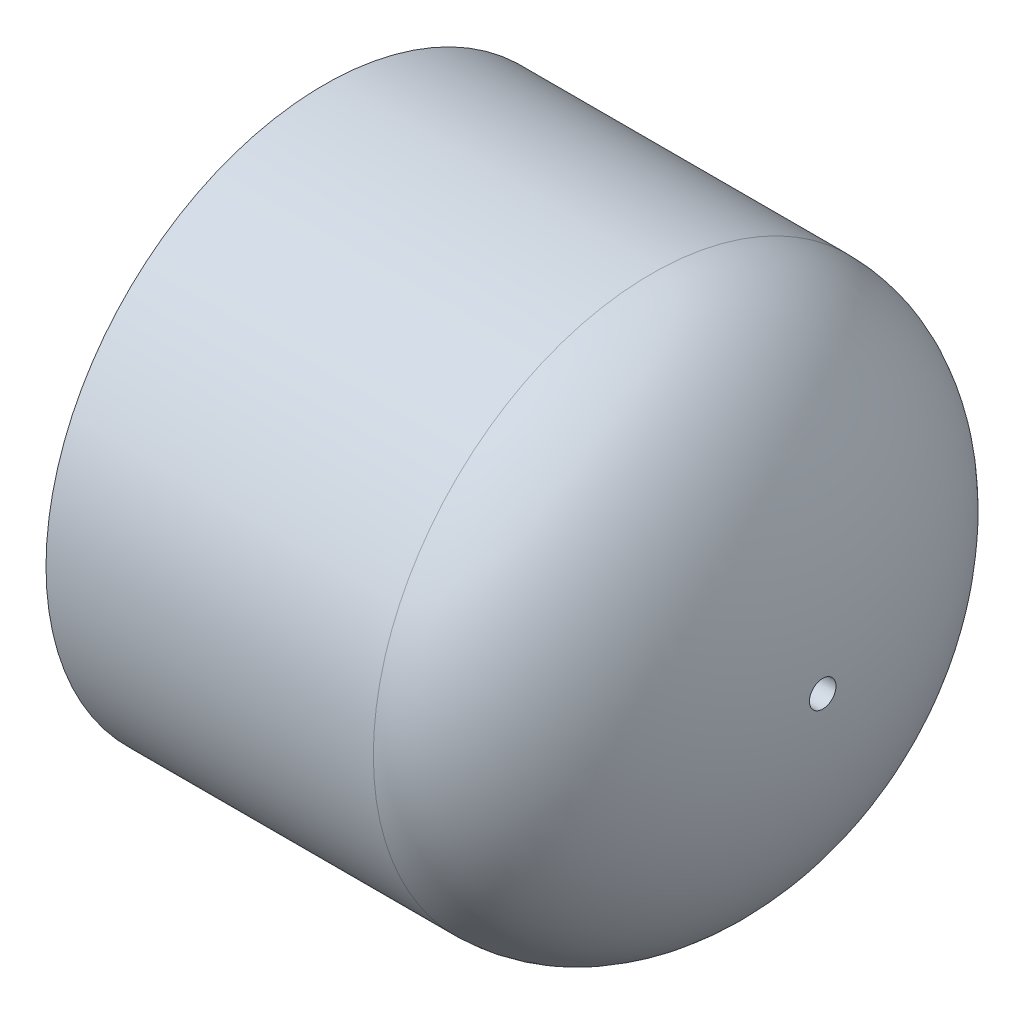
ISO-10303-21;
HEADER;
FILE_DESCRIPTION(('STEP AP214'),'2;1');
FILE_NAME('part.step','',(''),(''),'','','');
FILE_SCHEMA(('AUTOMOTIVE_DESIGN { 1 0 10303 214 1 1 1 1 }'));
ENDSEC;
DATA;
#1=APPLICATION_CONTEXT('core data for automotive mechanical design processes');
#2=APPLICATION_PROTOCOL_DEFINITION('international standard','automotive_design',2000,#1);
#3=PRODUCT_CONTEXT('',#1,'mechanical');
#4=PRODUCT('Part','Part','',(#3));
#5=PRODUCT_RELATED_PRODUCT_CATEGORY('part','',(#4));
#6=PRODUCT_DEFINITION_FORMATION('','',#4);
#7=PRODUCT_DEFINITION_CONTEXT('part definition',#1,'design');
#8=PRODUCT_DEFINITION('design','',#6,#7);
#9=PRODUCT_DEFINITION_SHAPE('','',#8);
#10=(LENGTH_UNIT() NAMED_UNIT(*) SI_UNIT(.MILLI.,.METRE.));
#11=(NAMED_UNIT(*) PLANE_ANGLE_UNIT() SI_UNIT($,.RADIAN.));
#12=(NAMED_UNIT(*) SI_UNIT($,.STERADIAN.) SOLID_ANGLE_UNIT());
#13=UNCERTAINTY_MEASURE_WITH_UNIT(LENGTH_MEASURE(1.E-05),#10,'distance_accuracy_value','');
#14=(GEOMETRIC_REPRESENTATION_CONTEXT(3) GLOBAL_UNCERTAINTY_ASSIGNED_CONTEXT((#13)) GLOBAL_UNIT_ASSIGNED_CONTEXT((#10,
#11,#12)) REPRESENTATION_CONTEXT('',''));
#15=CARTESIAN_POINT('',(0.,0.,0.));
#16=DIRECTION('',(0.,0.,1.));
#17=DIRECTION('',(1.,0.,0.));
#18=AXIS2_PLACEMENT_3D('',#15,#16,#17);
#19=CARTESIAN_POINT('',(-25.4,0.,0.));
#20=DIRECTION('',(-1.,0.,0.));
#21=DIRECTION('',(0.,0.,1.));
#22=AXIS2_PLACEMENT_3D('',#19,#20,#21);
#23=CYLINDRICAL_SURFACE('',#22,28.321);
#24=CARTESIAN_POINT('',(7.93750000000001,0.,0.));
#25=DIRECTION('',(-1.,0.,0.));
#26=DIRECTION('',(0.,0.,1.));
#27=AXIS2_PLACEMENT_3D('',#24,#25,#26);
#28=CIRCLE('',#27,28.321);
#29=CARTESIAN_POINT('',(7.93750000000001,0.,28.321));
#30=VERTEX_POINT('',#29);
#31=EDGE_CURVE('E10',#30,#30,#28,.T.);
#32=ORIENTED_EDGE('',*,*,#31,.T.);
#33=EDGE_LOOP('',(#32));
#34=FACE_BOUND('',#33,.T.);
#35=CARTESIAN_POINT('',(-25.4,0.,0.));
#36=DIRECTION('',(-1.,0.,0.));
#37=DIRECTION('',(0.,0.,1.));
#38=AXIS2_PLACEMENT_3D('',#35,#36,#37);
#39=CIRCLE('',#38,28.321);
#40=CARTESIAN_POINT('',(-25.4,0.,28.321));
#41=VERTEX_POINT('',#40);
#42=EDGE_CURVE('E51',#41,#41,#39,.T.);
#43=ORIENTED_EDGE('',*,*,#42,.F.);
#44=EDGE_LOOP('',(#43));
#45=FACE_BOUND('',#44,.T.);
#46=ADVANCED_FACE('F35',(#34,#45),#23,.T.);
#47=CARTESIAN_POINT('',(7.93750000000001,0.,0.));
#48=DIRECTION('',(0.,0.,1.));
#49=DIRECTION('',(0.,1.,0.));
#50=AXIS2_PLACEMENT_3D('',#47,#48,#49);
#51=ELLIPSE('',#50,28.321,17.4625);
#52=TRIMMED_CURVE('',#51,(PARAMETER_VALUE(1.5707963267949)),(PARAMETER_VALUE(4.71238898038469)),
.T.,.PARAMETER.);
#53=CARTESIAN_POINT('',(-25.4,0.,0.));
#54=DIRECTION('',(-1.,0.,0.));
#55=AXIS1_PLACEMENT('',#53,#54);
#56=SURFACE_OF_REVOLUTION('',#52,#55);
#57=CARTESIAN_POINT('',(25.3800742920315,0.,0.));
#58=DIRECTION('',(-1.,0.,0.));
#59=DIRECTION('',(0.,0.,1.));
#60=AXIS2_PLACEMENT_3D('',#57,#58,#59);
#61=CIRCLE('',#60,1.35254999999999);
#62=CARTESIAN_POINT('',(25.3800742920315,0.,1.35254999999999));
#63=VERTEX_POINT('',#62);
#64=EDGE_CURVE('E38',#63,#63,#61,.F.);
#65=ORIENTED_EDGE('',*,*,#64,.F.);
#66=EDGE_LOOP('',(#65));
#67=FACE_BOUND('',#66,.T.);
#68=ORIENTED_EDGE('',*,*,#31,.F.);
#69=EDGE_LOOP('',(#68));
#70=FACE_BOUND('',#69,.T.);
#71=ADVANCED_FACE('F64',(#67,#70),#56,.F.);
#72=CARTESIAN_POINT('',(7.93750000000001,0.,0.));
#73=DIRECTION('',(0.,0.,-1.));
#74=DIRECTION('',(0.,-1.,0.));
#75=AXIS2_PLACEMENT_3D('',#72,#73,#74);
#76=ELLIPSE('',#75,24.0538,13.1953);
#77=TRIMMED_CURVE('',#76,(PARAMETER_VALUE(4.71238898038469)),
(PARAMETER_VALUE(7.85398163397448)),.T.,.PARAMETER.);
#78=CARTESIAN_POINT('',(-25.4,0.,0.));
#79=DIRECTION('',(-1.,0.,0.));
#80=AXIS1_PLACEMENT('',#78,#79);
#81=SURFACE_OF_REVOLUTION('',#77,#80);
#82=CARTESIAN_POINT('',(21.111922800623,0.,0.));
#83=DIRECTION('',(-1.,0.,0.));
#84=DIRECTION('',(0.,0.,1.));
#85=AXIS2_PLACEMENT_3D('',#82,#83,#84);
#86=CIRCLE('',#85,1.35254999999999);
#87=CARTESIAN_POINT('',(21.111922800623,0.,1.35254999999999));
#88=VERTEX_POINT('',#87);
#89=EDGE_CURVE('E54',#88,#88,#86,.T.);
#90=ORIENTED_EDGE('',*,*,#89,.F.);
#91=EDGE_LOOP('',(#90));
#92=FACE_BOUND('',#91,.T.);
#93=CARTESIAN_POINT('',(7.93750000000001,0.,0.));
#94=DIRECTION('',(-1.,0.,0.));
#95=DIRECTION('',(0.,0.,1.));
#96=AXIS2_PLACEMENT_3D('',#93,#94,#95);
#97=CIRCLE('',#96,24.0538);
#98=CARTESIAN_POINT('',(7.93750000000001,0.,24.0538));
#99=VERTEX_POINT('',#98);
#100=EDGE_CURVE('E42',#99,#99,#97,.T.);
#101=ORIENTED_EDGE('',*,*,#100,.T.);
#102=EDGE_LOOP('',(#101));
#103=FACE_BOUND('',#102,.T.);
#104=ADVANCED_FACE('F60',(#92,#103),#81,.F.);
#105=CARTESIAN_POINT('',(7.93750000000001,0.,0.));
#106=DIRECTION('',(-1.,0.,0.));
#107=DIRECTION('',(0.,0.,1.));
#108=AXIS2_PLACEMENT_3D('',#105,#106,#107);
#109=CONICAL_SURFACE('',#108,24.0538,0.00685703538495628);
#110=CARTESIAN_POINT('',(-25.4,0.,0.));
#111=DIRECTION('',(-1.,0.,0.));
#112=DIRECTION('',(0.,0.,1.));
#113=AXIS2_PLACEMENT_3D('',#110,#111,#112);
#114=CIRCLE('',#113,24.2824);
#115=CARTESIAN_POINT('',(-25.4,0.,24.2824));
#116=VERTEX_POINT('',#115);
#117=EDGE_CURVE('E46',#116,#116,#114,.T.);
#118=ORIENTED_EDGE('',*,*,#117,.T.);
#119=EDGE_LOOP('',(#118));
#120=FACE_BOUND('',#119,.T.);
#121=ORIENTED_EDGE('',*,*,#100,.F.);
#122=EDGE_LOOP('',(#121));
#123=FACE_BOUND('',#122,.T.);
#124=ADVANCED_FACE('F63',(#120,#123),#109,.F.);
#125=CARTESIAN_POINT('',(-25.4,-28.321,0.));
#126=DIRECTION('',(-1.,0.,0.));
#127=DIRECTION('',(0.,0.,1.));
#128=AXIS2_PLACEMENT_3D('',#125,#126,#127);
#129=PLANE('',#128);
#130=ORIENTED_EDGE('',*,*,#42,.T.);
#131=EDGE_LOOP('',(#130));
#132=FACE_BOUND('',#131,.T.);
#133=ORIENTED_EDGE('',*,*,#117,.F.);
#134=EDGE_LOOP('',(#133));
#135=FACE_BOUND('',#134,.T.);
#136=ADVANCED_FACE('F85',(#132,#135),#129,.T.);
#137=CARTESIAN_POINT('',(-25.4,0.,0.));
#138=DIRECTION('',(-1.,0.,0.));
#139=DIRECTION('',(0.,0.,1.));
#140=AXIS2_PLACEMENT_3D('',#137,#138,#139);
#141=CYLINDRICAL_SURFACE('',#140,1.35254999999999);
#142=ORIENTED_EDGE('',*,*,#89,.T.);
#143=EDGE_LOOP('',(#142));
#144=FACE_BOUND('',#143,.T.);
#145=ORIENTED_EDGE('',*,*,#64,.T.);
#146=EDGE_LOOP('',(#145));
#147=FACE_BOUND('',#146,.T.);
#148=ADVANCED_FACE('F80',(#144,#147),#141,.F.);
#149=CLOSED_SHELL('',(#46,#71,#104,#124,#136,#148));
#150=MANIFOLD_SOLID_BREP('B2',#149);
#151=ADVANCED_BREP_SHAPE_REPRESENTATION('',(#18,#150),#14);
#152=SHAPE_DEFINITION_REPRESENTATION(#9,#151);
ENDSEC;
END-ISO-10303-21;
